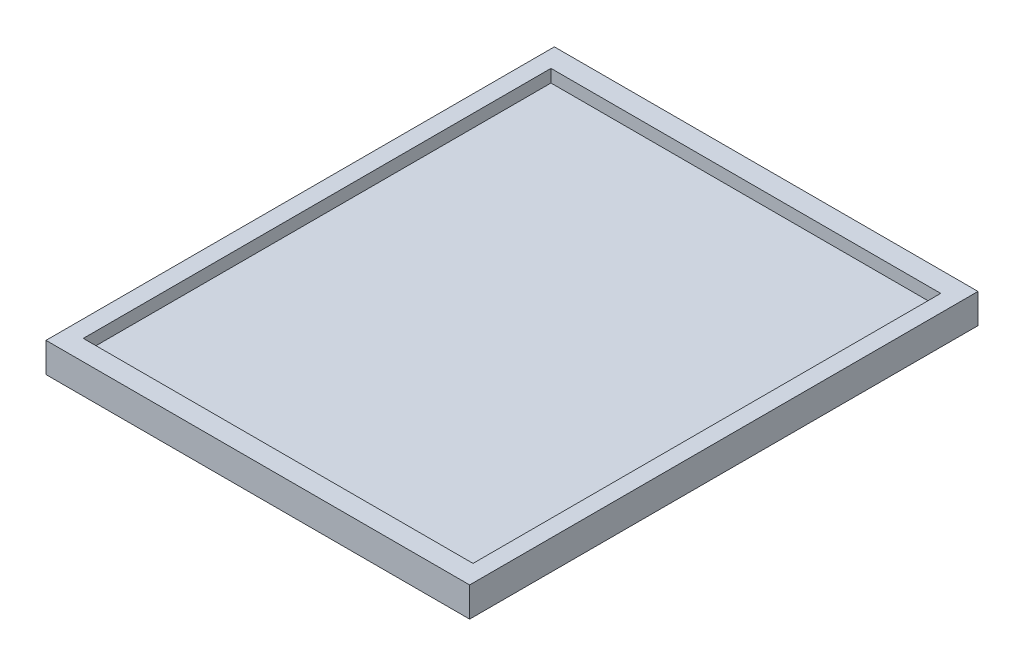
ISO-10303-21;
HEADER;
FILE_DESCRIPTION(('STEP AP214'),'2;1');
FILE_NAME('part.step','',(''),(''),'','','');
FILE_SCHEMA(('AUTOMOTIVE_DESIGN { 1 0 10303 214 1 1 1 1 }'));
ENDSEC;
DATA;
#1=APPLICATION_CONTEXT('core data for automotive mechanical design processes');
#2=APPLICATION_PROTOCOL_DEFINITION('international standard','automotive_design',2000,#1);
#3=PRODUCT_CONTEXT('',#1,'mechanical');
#4=PRODUCT('Part','Part','',(#3));
#5=PRODUCT_RELATED_PRODUCT_CATEGORY('part','',(#4));
#6=PRODUCT_DEFINITION_FORMATION('','',#4);
#7=PRODUCT_DEFINITION_CONTEXT('part definition',#1,'design');
#8=PRODUCT_DEFINITION('design','',#6,#7);
#9=PRODUCT_DEFINITION_SHAPE('','',#8);
#10=(LENGTH_UNIT() NAMED_UNIT(*) SI_UNIT(.MILLI.,.METRE.));
#11=(NAMED_UNIT(*) PLANE_ANGLE_UNIT() SI_UNIT($,.RADIAN.));
#12=(NAMED_UNIT(*) SI_UNIT($,.STERADIAN.) SOLID_ANGLE_UNIT());
#13=UNCERTAINTY_MEASURE_WITH_UNIT(LENGTH_MEASURE(1.E-05),#10,'distance_accuracy_value','');
#14=(GEOMETRIC_REPRESENTATION_CONTEXT(3) GLOBAL_UNCERTAINTY_ASSIGNED_CONTEXT((#13)) GLOBAL_UNIT_ASSIGNED_CONTEXT((#10,
#11,#12)) REPRESENTATION_CONTEXT('',''));
#15=CARTESIAN_POINT('',(0.,0.,0.));
#16=DIRECTION('',(0.,0.,1.));
#17=DIRECTION('',(1.,0.,0.));
#18=AXIS2_PLACEMENT_3D('',#15,#16,#17);
#19=CARTESIAN_POINT('',(0.,4.,0.));
#20=DIRECTION('',(1.,0.,0.));
#21=DIRECTION('',(0.,0.,-1.));
#22=AXIS2_PLACEMENT_3D('',#19,#20,#21);
#23=PLANE('',#22);
#24=DIRECTION('',(0.,0.,1.));
#25=VECTOR('',#24,1.);
#26=CARTESIAN_POINT('',(0.,0.,0.));
#27=LINE('',#26,#25);
#28=CARTESIAN_POINT('',(0.,0.,-120.));
#29=VERTEX_POINT('',#28);
#30=CARTESIAN_POINT('',(0.,0.,0.));
#31=VERTEX_POINT('',#30);
#32=EDGE_CURVE('E151',#29,#31,#27,.T.);
#33=ORIENTED_EDGE('',*,*,#32,.T.);
#34=DIRECTION('',(0.,-1.,0.));
#35=VECTOR('',#34,1.);
#36=CARTESIAN_POINT('',(0.,4.,0.));
#37=LINE('',#36,#35);
#38=CARTESIAN_POINT('',(0.,7.,0.));
#39=VERTEX_POINT('',#38);
#40=EDGE_CURVE('E11',#39,#31,#37,.T.);
#41=ORIENTED_EDGE('',*,*,#40,.F.);
#42=DIRECTION('',(0.,0.,1.));
#43=VECTOR('',#42,1.);
#44=CARTESIAN_POINT('',(0.,7.,-120.));
#45=LINE('',#44,#43);
#46=CARTESIAN_POINT('',(0.,7.,-120.));
#47=VERTEX_POINT('',#46);
#48=EDGE_CURVE('E114',#47,#39,#45,.T.);
#49=ORIENTED_EDGE('',*,*,#48,.F.);
#50=DIRECTION('',(0.,-1.,0.));
#51=VECTOR('',#50,1.);
#52=CARTESIAN_POINT('',(0.,4.,-120.));
#53=LINE('',#52,#51);
#54=EDGE_CURVE('E159',#47,#29,#53,.T.);
#55=ORIENTED_EDGE('',*,*,#54,.T.);
#56=EDGE_LOOP('',(#33,#41,#49,#55));
#57=FACE_BOUND('',#56,.T.);
#58=ADVANCED_FACE('F33',(#57),#23,.F.);
#59=CARTESIAN_POINT('',(0.,4.,0.));
#60=DIRECTION('',(0.,0.,-1.));
#61=DIRECTION('',(-1.,0.,0.));
#62=AXIS2_PLACEMENT_3D('',#59,#60,#61);
#63=PLANE('',#62);
#64=DIRECTION('',(1.,0.,0.));
#65=VECTOR('',#64,1.);
#66=CARTESIAN_POINT('',(0.,0.,0.));
#67=LINE('',#66,#65);
#68=CARTESIAN_POINT('',(100.,0.,0.));
#69=VERTEX_POINT('',#68);
#70=EDGE_CURVE('E154',#31,#69,#67,.T.);
#71=ORIENTED_EDGE('',*,*,#70,.T.);
#72=DIRECTION('',(0.,-1.,0.));
#73=VECTOR('',#72,1.);
#74=CARTESIAN_POINT('',(100.,4.,0.));
#75=LINE('',#74,#73);
#76=CARTESIAN_POINT('',(100.,7.,0.));
#77=VERTEX_POINT('',#76);
#78=EDGE_CURVE('E40',#77,#69,#75,.T.);
#79=ORIENTED_EDGE('',*,*,#78,.F.);
#80=DIRECTION('',(1.,0.,0.));
#81=VECTOR('',#80,1.);
#82=CARTESIAN_POINT('',(0.,7.,0.));
#83=LINE('',#82,#81);
#84=EDGE_CURVE('E133',#39,#77,#83,.T.);
#85=ORIENTED_EDGE('',*,*,#84,.F.);
#86=ORIENTED_EDGE('',*,*,#40,.T.);
#87=EDGE_LOOP('',(#71,#79,#85,#86));
#88=FACE_BOUND('',#87,.T.);
#89=ADVANCED_FACE('F177',(#88),#63,.F.);
#90=CARTESIAN_POINT('',(100.,4.,0.));
#91=DIRECTION('',(-1.,0.,0.));
#92=DIRECTION('',(0.,0.,1.));
#93=AXIS2_PLACEMENT_3D('',#90,#91,#92);
#94=PLANE('',#93);
#95=DIRECTION('',(0.,0.,-1.));
#96=VECTOR('',#95,1.);
#97=CARTESIAN_POINT('',(100.,0.,0.));
#98=LINE('',#97,#96);
#99=CARTESIAN_POINT('',(100.,0.,-120.));
#100=VERTEX_POINT('',#99);
#101=EDGE_CURVE('E156',#69,#100,#98,.T.);
#102=ORIENTED_EDGE('',*,*,#101,.T.);
#103=DIRECTION('',(0.,-1.,0.));
#104=VECTOR('',#103,1.);
#105=CARTESIAN_POINT('',(100.,4.,-120.));
#106=LINE('',#105,#104);
#107=CARTESIAN_POINT('',(100.,7.,-120.));
#108=VERTEX_POINT('',#107);
#109=EDGE_CURVE('E161',#108,#100,#106,.T.);
#110=ORIENTED_EDGE('',*,*,#109,.F.);
#111=DIRECTION('',(0.,0.,-1.));
#112=VECTOR('',#111,1.);
#113=CARTESIAN_POINT('',(100.,7.,-120.));
#114=LINE('',#113,#112);
#115=EDGE_CURVE('E136',#77,#108,#114,.T.);
#116=ORIENTED_EDGE('',*,*,#115,.F.);
#117=ORIENTED_EDGE('',*,*,#78,.T.);
#118=EDGE_LOOP('',(#102,#110,#116,#117));
#119=FACE_BOUND('',#118,.T.);
#120=ADVANCED_FACE('F166',(#119),#94,.F.);
#121=CARTESIAN_POINT('',(0.,4.,-120.));
#122=DIRECTION('',(0.,0.,1.));
#123=DIRECTION('',(1.,0.,0.));
#124=AXIS2_PLACEMENT_3D('',#121,#122,#123);
#125=PLANE('',#124);
#126=DIRECTION('',(-1.,0.,0.));
#127=VECTOR('',#126,1.);
#128=CARTESIAN_POINT('',(0.,0.,-120.));
#129=LINE('',#128,#127);
#130=EDGE_CURVE('E55',#100,#29,#129,.T.);
#131=ORIENTED_EDGE('',*,*,#130,.T.);
#132=ORIENTED_EDGE('',*,*,#54,.F.);
#133=DIRECTION('',(-1.,0.,0.));
#134=VECTOR('',#133,1.);
#135=CARTESIAN_POINT('',(0.,7.,-120.));
#136=LINE('',#135,#134);
#137=EDGE_CURVE('E139',#108,#47,#136,.T.);
#138=ORIENTED_EDGE('',*,*,#137,.F.);
#139=ORIENTED_EDGE('',*,*,#109,.T.);
#140=EDGE_LOOP('',(#131,#132,#138,#139));
#141=FACE_BOUND('',#140,.T.);
#142=ADVANCED_FACE('F175',(#141),#125,.F.);
#143=CARTESIAN_POINT('',(0.,0.,0.));
#144=DIRECTION('',(0.,-1.,0.));
#145=DIRECTION('',(0.,0.,-1.));
#146=AXIS2_PLACEMENT_3D('',#143,#144,#145);
#147=PLANE('',#146);
#148=ORIENTED_EDGE('',*,*,#32,.F.);
#149=ORIENTED_EDGE('',*,*,#130,.F.);
#150=ORIENTED_EDGE('',*,*,#101,.F.);
#151=ORIENTED_EDGE('',*,*,#70,.F.);
#152=EDGE_LOOP('',(#148,#149,#150,#151));
#153=FACE_BOUND('',#152,.T.);
#154=ADVANCED_FACE('F171',(#153),#147,.T.);
#155=CARTESIAN_POINT('',(4.,7.,-115.2));
#156=DIRECTION('',(1.,0.,0.));
#157=DIRECTION('',(0.,0.,-1.));
#158=AXIS2_PLACEMENT_3D('',#155,#156,#157);
#159=PLANE('',#158);
#160=DIRECTION('',(0.,0.,1.));
#161=VECTOR('',#160,1.);
#162=CARTESIAN_POINT('',(4.00000000000002,4.,0.));
#163=LINE('',#162,#161);
#164=CARTESIAN_POINT('',(4.,4.,-115.2));
#165=VERTEX_POINT('',#164);
#166=CARTESIAN_POINT('',(4.00000000000001,4.,-4.79999999999998));
#167=VERTEX_POINT('',#166);
#168=EDGE_CURVE('E149',#165,#167,#163,.T.);
#169=ORIENTED_EDGE('',*,*,#168,.F.);
#170=DIRECTION('',(0.,-1.,0.));
#171=VECTOR('',#170,1.);
#172=CARTESIAN_POINT('',(4.,7.,-115.2));
#173=LINE('',#172,#171);
#174=CARTESIAN_POINT('',(4.,7.,-115.2));
#175=VERTEX_POINT('',#174);
#176=EDGE_CURVE('E47',#175,#165,#173,.T.);
#177=ORIENTED_EDGE('',*,*,#176,.F.);
#178=DIRECTION('',(0.,0.,1.));
#179=VECTOR('',#178,1.);
#180=CARTESIAN_POINT('',(4.,7.,-115.2));
#181=LINE('',#180,#179);
#182=CARTESIAN_POINT('',(4.00000000000001,7.,-4.79999999999998));
#183=VERTEX_POINT('',#182);
#184=EDGE_CURVE('E98',#175,#183,#181,.T.);
#185=ORIENTED_EDGE('',*,*,#184,.T.);
#186=DIRECTION('',(0.,-1.,0.));
#187=VECTOR('',#186,1.);
#188=CARTESIAN_POINT('',(4.00000000000001,7.,-4.79999999999998));
#189=LINE('',#188,#187);
#190=EDGE_CURVE('E101',#183,#167,#189,.T.);
#191=ORIENTED_EDGE('',*,*,#190,.T.);
#192=EDGE_LOOP('',(#169,#177,#185,#191));
#193=FACE_BOUND('',#192,.T.);
#194=ADVANCED_FACE('F100',(#193),#159,.T.);
#195=CARTESIAN_POINT('',(4.00000000000001,7.,-4.79999999999998));
#196=DIRECTION('',(0.,0.,-1.));
#197=DIRECTION('',(-1.,0.,0.));
#198=AXIS2_PLACEMENT_3D('',#195,#196,#197);
#199=PLANE('',#198);
#200=DIRECTION('',(1.,0.,0.));
#201=VECTOR('',#200,1.);
#202=CARTESIAN_POINT('',(0.,4.,-4.79999999999998));
#203=LINE('',#202,#201);
#204=CARTESIAN_POINT('',(96.,4.,-4.79999999999998));
#205=VERTEX_POINT('',#204);
#206=EDGE_CURVE('E113',#167,#205,#203,.T.);
#207=ORIENTED_EDGE('',*,*,#206,.F.);
#208=ORIENTED_EDGE('',*,*,#190,.F.);
#209=DIRECTION('',(1.,0.,0.));
#210=VECTOR('',#209,1.);
#211=CARTESIAN_POINT('',(4.00000000000001,7.,-4.79999999999998));
#212=LINE('',#211,#210);
#213=CARTESIAN_POINT('',(96.,7.,-4.79999999999998));
#214=VERTEX_POINT('',#213);
#215=EDGE_CURVE('E106',#183,#214,#212,.T.);
#216=ORIENTED_EDGE('',*,*,#215,.T.);
#217=DIRECTION('',(0.,-1.,0.));
#218=VECTOR('',#217,1.);
#219=CARTESIAN_POINT('',(96.,7.,-4.79999999999998));
#220=LINE('',#219,#218);
#221=EDGE_CURVE('E115',#214,#205,#220,.T.);
#222=ORIENTED_EDGE('',*,*,#221,.T.);
#223=EDGE_LOOP('',(#207,#208,#216,#222));
#224=FACE_BOUND('',#223,.T.);
#225=ADVANCED_FACE('F109',(#224),#199,.T.);
#226=CARTESIAN_POINT('',(96.,7.,-115.2));
#227=DIRECTION('',(-1.,0.,0.));
#228=DIRECTION('',(0.,0.,1.));
#229=AXIS2_PLACEMENT_3D('',#226,#227,#228);
#230=PLANE('',#229);
#231=DIRECTION('',(0.,0.,-1.));
#232=VECTOR('',#231,1.);
#233=CARTESIAN_POINT('',(96.,4.,0.));
#234=LINE('',#233,#232);
#235=CARTESIAN_POINT('',(96.,4.,-115.2));
#236=VERTEX_POINT('',#235);
#237=EDGE_CURVE('E145',#205,#236,#234,.T.);
#238=ORIENTED_EDGE('',*,*,#237,.F.);
#239=ORIENTED_EDGE('',*,*,#221,.F.);
#240=DIRECTION('',(0.,0.,-1.));
#241=VECTOR('',#240,1.);
#242=CARTESIAN_POINT('',(96.,7.,-115.2));
#243=LINE('',#242,#241);
#244=CARTESIAN_POINT('',(96.,7.,-115.2));
#245=VERTEX_POINT('',#244);
#246=EDGE_CURVE('E120',#214,#245,#243,.T.);
#247=ORIENTED_EDGE('',*,*,#246,.T.);
#248=DIRECTION('',(0.,-1.,0.));
#249=VECTOR('',#248,1.);
#250=CARTESIAN_POINT('',(96.,7.,-115.2));
#251=LINE('',#250,#249);
#252=EDGE_CURVE('E127',#245,#236,#251,.T.);
#253=ORIENTED_EDGE('',*,*,#252,.T.);
#254=EDGE_LOOP('',(#238,#239,#247,#253));
#255=FACE_BOUND('',#254,.T.);
#256=ADVANCED_FACE('F200',(#255),#230,.T.);
#257=CARTESIAN_POINT('',(4.,7.,-115.2));
#258=DIRECTION('',(0.,0.,1.));
#259=DIRECTION('',(1.,0.,0.));
#260=AXIS2_PLACEMENT_3D('',#257,#258,#259);
#261=PLANE('',#260);
#262=DIRECTION('',(-1.,0.,0.));
#263=VECTOR('',#262,1.);
#264=CARTESIAN_POINT('',(0.,4.,-115.2));
#265=LINE('',#264,#263);
#266=EDGE_CURVE('E142',#236,#165,#265,.T.);
#267=ORIENTED_EDGE('',*,*,#266,.F.);
#268=ORIENTED_EDGE('',*,*,#252,.F.);
#269=DIRECTION('',(-1.,0.,0.));
#270=VECTOR('',#269,1.);
#271=CARTESIAN_POINT('',(4.,7.,-115.2));
#272=LINE('',#271,#270);
#273=EDGE_CURVE('E122',#245,#175,#272,.T.);
#274=ORIENTED_EDGE('',*,*,#273,.T.);
#275=ORIENTED_EDGE('',*,*,#176,.T.);
#276=EDGE_LOOP('',(#267,#268,#274,#275));
#277=FACE_BOUND('',#276,.T.);
#278=ADVANCED_FACE('F195',(#277),#261,.T.);
#279=CARTESIAN_POINT('',(0.,7.,0.));
#280=DIRECTION('',(0.,1.,0.));
#281=DIRECTION('',(0.,0.,1.));
#282=AXIS2_PLACEMENT_3D('',#279,#280,#281);
#283=PLANE('',#282);
#284=ORIENTED_EDGE('',*,*,#48,.T.);
#285=ORIENTED_EDGE('',*,*,#84,.T.);
#286=ORIENTED_EDGE('',*,*,#115,.T.);
#287=ORIENTED_EDGE('',*,*,#137,.T.);
#288=EDGE_LOOP('',(#284,#285,#286,#287));
#289=FACE_BOUND('',#288,.T.);
#290=ORIENTED_EDGE('',*,*,#215,.F.);
#291=ORIENTED_EDGE('',*,*,#184,.F.);
#292=ORIENTED_EDGE('',*,*,#273,.F.);
#293=ORIENTED_EDGE('',*,*,#246,.F.);
#294=EDGE_LOOP('',(#290,#291,#292,#293));
#295=FACE_BOUND('',#294,.T.);
#296=ADVANCED_FACE('F118',(#289,#295),#283,.T.);
#297=CARTESIAN_POINT('',(0.,4.,0.));
#298=DIRECTION('',(0.,-1.,0.));
#299=DIRECTION('',(0.,0.,-1.));
#300=AXIS2_PLACEMENT_3D('',#297,#298,#299);
#301=PLANE('',#300);
#302=ORIENTED_EDGE('',*,*,#266,.T.);
#303=ORIENTED_EDGE('',*,*,#168,.T.);
#304=ORIENTED_EDGE('',*,*,#206,.T.);
#305=ORIENTED_EDGE('',*,*,#237,.T.);
#306=EDGE_LOOP('',(#302,#303,#304,#305));
#307=FACE_BOUND('',#306,.T.);
#308=ADVANCED_FACE('F189',(#307),#301,.F.);
#309=CLOSED_SHELL('',(#58,#89,#120,#142,#154,#194,#225,#256,#278,#296,#308));
#310=MANIFOLD_SOLID_BREP('B2',#309);
#311=ADVANCED_BREP_SHAPE_REPRESENTATION('',(#18,#310),#14);
#312=SHAPE_DEFINITION_REPRESENTATION(#9,#311);
ENDSEC;
END-ISO-10303-21;
